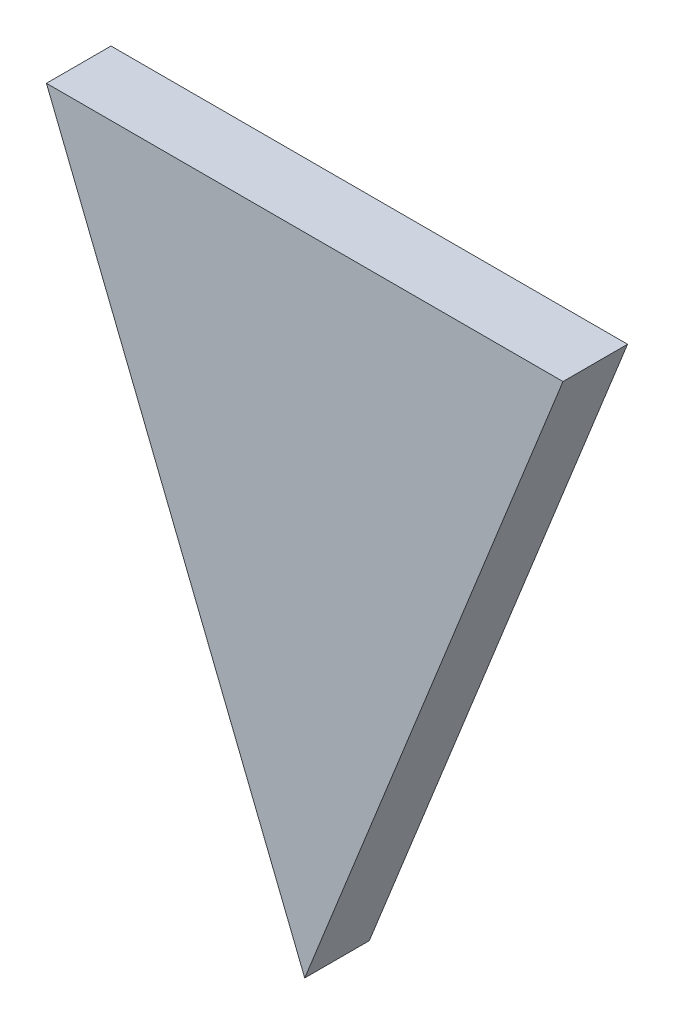
ISO-10303-21;
HEADER;
FILE_DESCRIPTION(('STEP AP214'),'2;1');
FILE_NAME('part.step','',(''),(''),'','','');
FILE_SCHEMA(('AUTOMOTIVE_DESIGN { 1 0 10303 214 1 1 1 1 }'));
ENDSEC;
DATA;
#1=APPLICATION_CONTEXT('core data for automotive mechanical design processes');
#2=APPLICATION_PROTOCOL_DEFINITION('international standard','automotive_design',2000,#1);
#3=PRODUCT_CONTEXT('',#1,'mechanical');
#4=PRODUCT('Part','Part','',(#3));
#5=PRODUCT_RELATED_PRODUCT_CATEGORY('part','',(#4));
#6=PRODUCT_DEFINITION_FORMATION('','',#4);
#7=PRODUCT_DEFINITION_CONTEXT('part definition',#1,'design');
#8=PRODUCT_DEFINITION('design','',#6,#7);
#9=PRODUCT_DEFINITION_SHAPE('','',#8);
#10=(LENGTH_UNIT() NAMED_UNIT(*) SI_UNIT(.MILLI.,.METRE.));
#11=(NAMED_UNIT(*) PLANE_ANGLE_UNIT() SI_UNIT($,.RADIAN.));
#12=(NAMED_UNIT(*) SI_UNIT($,.STERADIAN.) SOLID_ANGLE_UNIT());
#13=UNCERTAINTY_MEASURE_WITH_UNIT(LENGTH_MEASURE(1.E-05),#10,'distance_accuracy_value','');
#14=(GEOMETRIC_REPRESENTATION_CONTEXT(3) GLOBAL_UNCERTAINTY_ASSIGNED_CONTEXT((#13)) GLOBAL_UNIT_ASSIGNED_CONTEXT((#10,
#11,#12)) REPRESENTATION_CONTEXT('',''));
#15=CARTESIAN_POINT('',(0.,0.,0.));
#16=DIRECTION('',(0.,0.,1.));
#17=DIRECTION('',(1.,0.,0.));
#18=AXIS2_PLACEMENT_3D('',#15,#16,#17);
#19=CARTESIAN_POINT('',(0.,0.,0.127));
#20=DIRECTION('',(0.,0.,1.));
#21=DIRECTION('',(1.,0.,0.));
#22=AXIS2_PLACEMENT_3D('',#19,#20,#21);
#23=PLANE('',#22);
#24=DIRECTION('',(-0.371390676354104,0.928476690885259,0.));
#25=VECTOR('',#24,1.);
#26=CARTESIAN_POINT('',(-0.508,1.27,0.127));
#27=LINE('',#26,#25);
#28=CARTESIAN_POINT('',(-0.508,1.27,0.127));
#29=VERTEX_POINT('',#28);
#30=CARTESIAN_POINT('',(0.,0.,0.127));
#31=VERTEX_POINT('',#30);
#32=EDGE_CURVE('E19',#29,#31,#27,.F.);
#33=ORIENTED_EDGE('',*,*,#32,.T.);
#34=DIRECTION('',(-0.371390676354104,-0.928476690885259,0.));
#35=VECTOR('',#34,1.);
#36=CARTESIAN_POINT('',(0.,0.,0.127));
#37=LINE('',#36,#35);
#38=CARTESIAN_POINT('',(0.508,1.27,0.127));
#39=VERTEX_POINT('',#38);
#40=EDGE_CURVE('E49',#31,#39,#37,.F.);
#41=ORIENTED_EDGE('',*,*,#40,.T.);
#42=DIRECTION('',(1.,0.,0.));
#43=VECTOR('',#42,1.);
#44=CARTESIAN_POINT('',(0.508,1.27,0.127));
#45=LINE('',#44,#43);
#46=EDGE_CURVE('E50',#39,#29,#45,.F.);
#47=ORIENTED_EDGE('',*,*,#46,.T.);
#48=EDGE_LOOP('',(#33,#41,#47));
#49=FACE_BOUND('',#48,.T.);
#50=ADVANCED_FACE('F16',(#49),#23,.T.);
#51=CARTESIAN_POINT('',(-0.508,1.27,0.127));
#52=DIRECTION('',(0.928476690885259,0.371390676354104,0.));
#53=DIRECTION('',(-0.371390676354104,0.928476690885259,0.));
#54=AXIS2_PLACEMENT_3D('',#51,#52,#53);
#55=PLANE('',#54);
#56=DIRECTION('',(0.,0.,1.));
#57=VECTOR('',#56,1.);
#58=CARTESIAN_POINT('',(0.,0.,0.127));
#59=LINE('',#58,#57);
#60=CARTESIAN_POINT('',(0.,0.,0.));
#61=VERTEX_POINT('',#60);
#62=EDGE_CURVE('E55',#61,#31,#59,.T.);
#63=ORIENTED_EDGE('',*,*,#62,.T.);
#64=ORIENTED_EDGE('',*,*,#32,.F.);
#65=DIRECTION('',(0.,0.,-1.));
#66=VECTOR('',#65,1.);
#67=CARTESIAN_POINT('',(-0.508,1.27,0.127));
#68=LINE('',#67,#66);
#69=CARTESIAN_POINT('',(-0.508,1.27,0.));
#70=VERTEX_POINT('',#69);
#71=EDGE_CURVE('E67',#29,#70,#68,.T.);
#72=ORIENTED_EDGE('',*,*,#71,.T.);
#73=DIRECTION('',(0.371390676354104,-0.928476690885259,0.));
#74=VECTOR('',#73,1.);
#75=CARTESIAN_POINT('',(-0.508,1.27,0.));
#76=LINE('',#75,#74);
#77=EDGE_CURVE('E63',#70,#61,#76,.T.);
#78=ORIENTED_EDGE('',*,*,#77,.T.);
#79=EDGE_LOOP('',(#63,#64,#72,#78));
#80=FACE_BOUND('',#79,.T.);
#81=ADVANCED_FACE('F62',(#80),#55,.F.);
#82=CARTESIAN_POINT('',(0.,0.,0.127));
#83=DIRECTION('',(-0.928476690885259,0.371390676354104,0.));
#84=DIRECTION('',(-0.371390676354104,-0.928476690885259,0.));
#85=AXIS2_PLACEMENT_3D('',#82,#83,#84);
#86=PLANE('',#85);
#87=DIRECTION('',(0.,0.,-1.));
#88=VECTOR('',#87,1.);
#89=CARTESIAN_POINT('',(0.508,1.27,0.127));
#90=LINE('',#89,#88);
#91=CARTESIAN_POINT('',(0.508,1.27,0.));
#92=VERTEX_POINT('',#91);
#93=EDGE_CURVE('E33',#92,#39,#90,.F.);
#94=ORIENTED_EDGE('',*,*,#93,.T.);
#95=ORIENTED_EDGE('',*,*,#40,.F.);
#96=ORIENTED_EDGE('',*,*,#62,.F.);
#97=DIRECTION('',(0.371390676354104,0.928476690885259,0.));
#98=VECTOR('',#97,1.);
#99=CARTESIAN_POINT('',(0.,0.,0.));
#100=LINE('',#99,#98);
#101=EDGE_CURVE('E25',#61,#92,#100,.T.);
#102=ORIENTED_EDGE('',*,*,#101,.T.);
#103=EDGE_LOOP('',(#94,#95,#96,#102));
#104=FACE_BOUND('',#103,.T.);
#105=ADVANCED_FACE('F57',(#104),#86,.F.);
#106=CARTESIAN_POINT('',(0.508,1.27,0.127));
#107=DIRECTION('',(0.,-1.,0.));
#108=DIRECTION('',(0.,0.,-1.));
#109=AXIS2_PLACEMENT_3D('',#106,#107,#108);
#110=PLANE('',#109);
#111=ORIENTED_EDGE('',*,*,#71,.F.);
#112=ORIENTED_EDGE('',*,*,#46,.F.);
#113=ORIENTED_EDGE('',*,*,#93,.F.);
#114=DIRECTION('',(1.,0.,0.));
#115=VECTOR('',#114,1.);
#116=CARTESIAN_POINT('',(0.,1.27,0.));
#117=LINE('',#116,#115);
#118=EDGE_CURVE('E11',#92,#70,#117,.F.);
#119=ORIENTED_EDGE('',*,*,#118,.T.);
#120=EDGE_LOOP('',(#111,#112,#113,#119));
#121=FACE_BOUND('',#120,.T.);
#122=ADVANCED_FACE('F72',(#121),#110,.F.);
#123=CARTESIAN_POINT('',(0.,0.,0.));
#124=DIRECTION('',(0.,0.,1.));
#125=DIRECTION('',(1.,0.,0.));
#126=AXIS2_PLACEMENT_3D('',#123,#124,#125);
#127=PLANE('',#126);
#128=ORIENTED_EDGE('',*,*,#101,.F.);
#129=ORIENTED_EDGE('',*,*,#77,.F.);
#130=ORIENTED_EDGE('',*,*,#118,.F.);
#131=EDGE_LOOP('',(#128,#129,#130));
#132=FACE_BOUND('',#131,.T.);
#133=ADVANCED_FACE('F71',(#132),#127,.F.);
#134=CLOSED_SHELL('',(#50,#81,#105,#122,#133));
#135=MANIFOLD_SOLID_BREP('B1',#134);
#136=ADVANCED_BREP_SHAPE_REPRESENTATION('',(#18,#135),#14);
#137=SHAPE_DEFINITION_REPRESENTATION(#9,#136);
ENDSEC;
END-ISO-10303-21;
